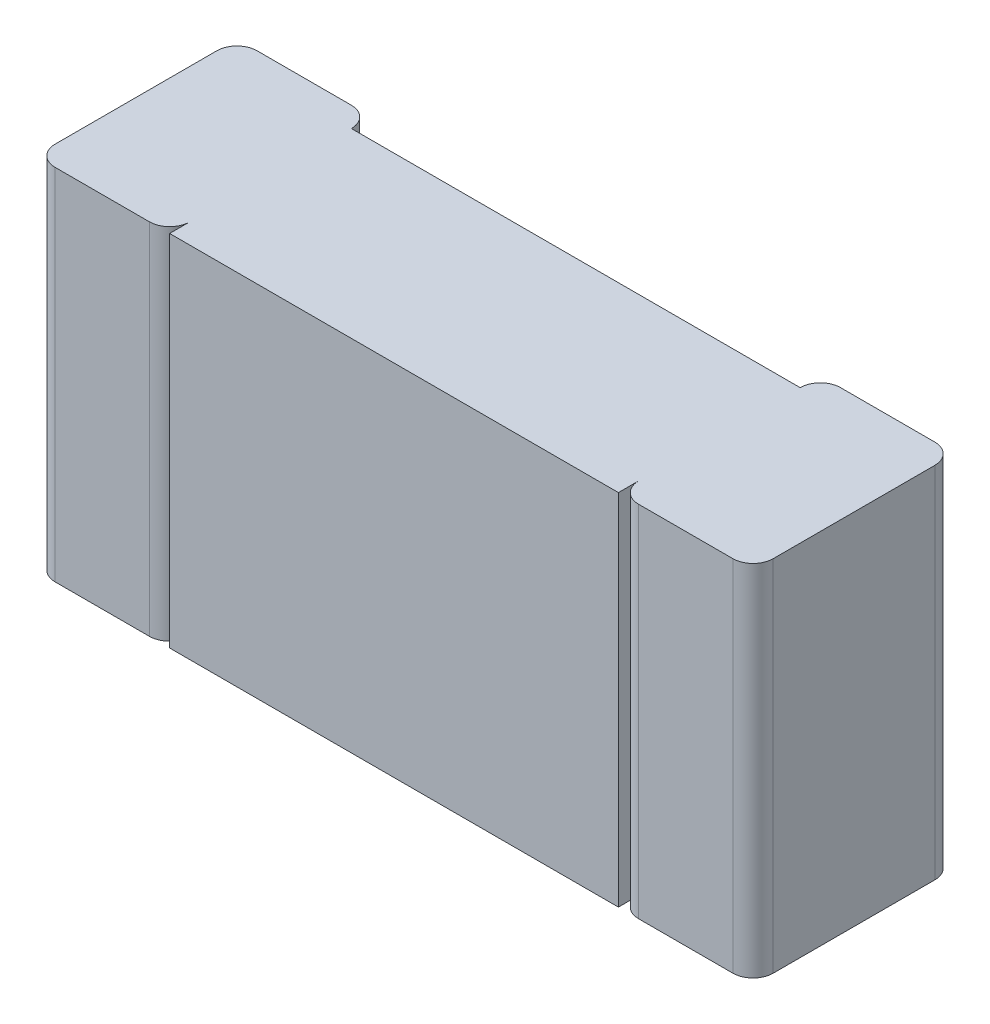
ISO-10303-21;
HEADER;
FILE_DESCRIPTION(('STEP AP214'),'2;1');
FILE_NAME('part.step','',(''),(''),'','','');
FILE_SCHEMA(('AUTOMOTIVE_DESIGN { 1 0 10303 214 1 1 1 1 }'));
ENDSEC;
DATA;
#1=APPLICATION_CONTEXT('core data for automotive mechanical design processes');
#2=APPLICATION_PROTOCOL_DEFINITION('international standard','automotive_design',2000,#1);
#3=PRODUCT_CONTEXT('',#1,'mechanical');
#4=PRODUCT('Part','Part','',(#3));
#5=PRODUCT_RELATED_PRODUCT_CATEGORY('part','',(#4));
#6=PRODUCT_DEFINITION_FORMATION('','',#4);
#7=PRODUCT_DEFINITION_CONTEXT('part definition',#1,'design');
#8=PRODUCT_DEFINITION('design','',#6,#7);
#9=PRODUCT_DEFINITION_SHAPE('','',#8);
#10=(LENGTH_UNIT() NAMED_UNIT(*) SI_UNIT(.MILLI.,.METRE.));
#11=(NAMED_UNIT(*) PLANE_ANGLE_UNIT() SI_UNIT($,.RADIAN.));
#12=(NAMED_UNIT(*) SI_UNIT($,.STERADIAN.) SOLID_ANGLE_UNIT());
#13=UNCERTAINTY_MEASURE_WITH_UNIT(LENGTH_MEASURE(1.E-05),#10,'distance_accuracy_value','');
#14=(GEOMETRIC_REPRESENTATION_CONTEXT(3) GLOBAL_UNCERTAINTY_ASSIGNED_CONTEXT((#13)) GLOBAL_UNIT_ASSIGNED_CONTEXT((#10,
#11,#12)) REPRESENTATION_CONTEXT('',''));
#15=CARTESIAN_POINT('',(0.,0.,0.));
#16=DIRECTION('',(0.,0.,1.));
#17=DIRECTION('',(1.,0.,0.));
#18=AXIS2_PLACEMENT_3D('',#15,#16,#17);
#19=CARTESIAN_POINT('',(-0.5,-0.4,0.405));
#20=DIRECTION('',(1.,0.,0.));
#21=DIRECTION('',(0.,0.,-1.));
#22=AXIS2_PLACEMENT_3D('',#19,#20,#21);
#23=PLANE('',#22);
#24=DIRECTION('',(0.,0.,-1.));
#25=VECTOR('',#24,1.);
#26=CARTESIAN_POINT('',(-0.5,0.4,0.405));
#27=LINE('',#26,#25);
#28=CARTESIAN_POINT('',(-0.5,0.4,0.405));
#29=VERTEX_POINT('',#28);
#30=CARTESIAN_POINT('',(-0.5,0.4,0.45));
#31=VERTEX_POINT('',#30);
#32=EDGE_CURVE('E197',#29,#31,#27,.F.);
#33=ORIENTED_EDGE('',*,*,#32,.F.);
#34=DIRECTION('',(0.,1.,0.));
#35=VECTOR('',#34,1.);
#36=CARTESIAN_POINT('',(-0.5,-0.4,0.405));
#37=LINE('',#36,#35);
#38=CARTESIAN_POINT('',(-0.5,-0.4,0.405));
#39=VERTEX_POINT('',#38);
#40=EDGE_CURVE('E182',#39,#29,#37,.T.);
#41=ORIENTED_EDGE('',*,*,#40,.F.);
#42=DIRECTION('',(0.,0.,-1.));
#43=VECTOR('',#42,1.);
#44=CARTESIAN_POINT('',(-0.5,-0.4,0.405));
#45=LINE('',#44,#43);
#46=CARTESIAN_POINT('',(-0.5,-0.4,0.45));
#47=VERTEX_POINT('',#46);
#48=EDGE_CURVE('E200',#47,#39,#45,.T.);
#49=ORIENTED_EDGE('',*,*,#48,.F.);
#50=DIRECTION('',(0.,1.,0.));
#51=VECTOR('',#50,1.);
#52=CARTESIAN_POINT('',(-0.5,-0.4,0.45));
#53=LINE('',#52,#51);
#54=EDGE_CURVE('E188',#31,#47,#53,.F.);
#55=ORIENTED_EDGE('',*,*,#54,.F.);
#56=EDGE_LOOP('',(#33,#41,#49,#55));
#57=FACE_BOUND('',#56,.T.);
#58=ADVANCED_FACE('F17',(#57),#23,.F.);
#59=CARTESIAN_POINT('',(0.5,-0.4,0.405));
#60=DIRECTION('',(1.,0.,0.));
#61=DIRECTION('',(0.,0.,-1.));
#62=AXIS2_PLACEMENT_3D('',#59,#60,#61);
#63=PLANE('',#62);
#64=DIRECTION('',(0.,0.,-1.));
#65=VECTOR('',#64,1.);
#66=CARTESIAN_POINT('',(0.5,0.4,0.405));
#67=LINE('',#66,#65);
#68=CARTESIAN_POINT('',(0.5,0.4,0.405));
#69=VERTEX_POINT('',#68);
#70=CARTESIAN_POINT('',(0.5,0.4,0.45));
#71=VERTEX_POINT('',#70);
#72=EDGE_CURVE('E143',#69,#71,#67,.F.);
#73=ORIENTED_EDGE('',*,*,#72,.T.);
#74=DIRECTION('',(0.,1.,0.));
#75=VECTOR('',#74,1.);
#76=CARTESIAN_POINT('',(0.5,-0.4,0.45));
#77=LINE('',#76,#75);
#78=CARTESIAN_POINT('',(0.5,-0.4,0.45));
#79=VERTEX_POINT('',#78);
#80=EDGE_CURVE('E177',#79,#71,#77,.T.);
#81=ORIENTED_EDGE('',*,*,#80,.F.);
#82=DIRECTION('',(0.,0.,-1.));
#83=VECTOR('',#82,1.);
#84=CARTESIAN_POINT('',(0.5,-0.4,0.405));
#85=LINE('',#84,#83);
#86=CARTESIAN_POINT('',(0.5,-0.4,0.405));
#87=VERTEX_POINT('',#86);
#88=EDGE_CURVE('E193',#79,#87,#85,.T.);
#89=ORIENTED_EDGE('',*,*,#88,.T.);
#90=DIRECTION('',(0.,1.,0.));
#91=VECTOR('',#90,1.);
#92=CARTESIAN_POINT('',(0.5,-0.4,0.405));
#93=LINE('',#92,#91);
#94=EDGE_CURVE('E174',#69,#87,#93,.F.);
#95=ORIENTED_EDGE('',*,*,#94,.F.);
#96=EDGE_LOOP('',(#73,#81,#89,#95));
#97=FACE_BOUND('',#96,.T.);
#98=ADVANCED_FACE('F419',(#97),#63,.T.);
#99=CARTESIAN_POINT('',(-0.755,-0.4,0.045));
#100=DIRECTION('',(0.,1.,0.));
#101=DIRECTION('',(0.,0.,1.));
#102=AXIS2_PLACEMENT_3D('',#99,#100,#101);
#103=CYLINDRICAL_SURFACE('',#102,0.045);
#104=DIRECTION('',(0.,1.,0.));
#105=VECTOR('',#104,1.);
#106=CARTESIAN_POINT('',(-0.755,-0.4,0.));
#107=LINE('',#106,#105);
#108=CARTESIAN_POINT('',(-0.755,0.4,0.));
#109=VERTEX_POINT('',#108);
#110=CARTESIAN_POINT('',(-0.755,-0.4,0.));
#111=VERTEX_POINT('',#110);
#112=EDGE_CURVE('E129',#109,#111,#107,.F.);
#113=ORIENTED_EDGE('',*,*,#112,.T.);
#114=CARTESIAN_POINT('',(-0.755,-0.4,0.045));
#115=DIRECTION('',(0.,1.,0.));
#116=DIRECTION('',(0.,0.,1.));
#117=AXIS2_PLACEMENT_3D('',#114,#115,#116);
#118=CIRCLE('',#117,0.045);
#119=CARTESIAN_POINT('',(-0.8,-0.4,0.045));
#120=VERTEX_POINT('',#119);
#121=EDGE_CURVE('E20',#111,#120,#118,.T.);
#122=ORIENTED_EDGE('',*,*,#121,.T.);
#123=DIRECTION('',(0.,1.,0.));
#124=VECTOR('',#123,1.);
#125=CARTESIAN_POINT('',(-0.8,-0.4,0.045));
#126=LINE('',#125,#124);
#127=CARTESIAN_POINT('',(-0.8,0.4,0.045));
#128=VERTEX_POINT('',#127);
#129=EDGE_CURVE('E136',#120,#128,#126,.T.);
#130=ORIENTED_EDGE('',*,*,#129,.T.);
#131=CARTESIAN_POINT('',(-0.755,0.4,0.045));
#132=DIRECTION('',(0.,1.,0.));
#133=DIRECTION('',(0.,0.,1.));
#134=AXIS2_PLACEMENT_3D('',#131,#132,#133);
#135=CIRCLE('',#134,0.045);
#136=EDGE_CURVE('E250',#109,#128,#135,.T.);
#137=ORIENTED_EDGE('',*,*,#136,.F.);
#138=EDGE_LOOP('',(#113,#122,#130,#137));
#139=FACE_BOUND('',#138,.T.);
#140=ADVANCED_FACE('F154',(#139),#103,.T.);
#141=CARTESIAN_POINT('',(-0.8,-0.4,0.));
#142=DIRECTION('',(1.,0.,0.));
#143=DIRECTION('',(0.,0.,-1.));
#144=AXIS2_PLACEMENT_3D('',#141,#142,#143);
#145=PLANE('',#144);
#146=DIRECTION('',(0.,0.,1.));
#147=VECTOR('',#146,1.);
#148=CARTESIAN_POINT('',(-0.8,0.4,0.));
#149=LINE('',#148,#147);
#150=CARTESIAN_POINT('',(-0.8,0.4,0.405));
#151=VERTEX_POINT('',#150);
#152=EDGE_CURVE('E141',#128,#151,#149,.T.);
#153=ORIENTED_EDGE('',*,*,#152,.F.);
#154=ORIENTED_EDGE('',*,*,#129,.F.);
#155=DIRECTION('',(0.,0.,1.));
#156=VECTOR('',#155,1.);
#157=CARTESIAN_POINT('',(-0.8,-0.4,0.));
#158=LINE('',#157,#156);
#159=CARTESIAN_POINT('',(-0.8,-0.4,0.405));
#160=VERTEX_POINT('',#159);
#161=EDGE_CURVE('E140',#120,#160,#158,.T.);
#162=ORIENTED_EDGE('',*,*,#161,.T.);
#163=DIRECTION('',(0.,1.,0.));
#164=VECTOR('',#163,1.);
#165=CARTESIAN_POINT('',(-0.8,-0.4,0.405));
#166=LINE('',#165,#164);
#167=EDGE_CURVE('E142',#151,#160,#166,.F.);
#168=ORIENTED_EDGE('',*,*,#167,.F.);
#169=EDGE_LOOP('',(#153,#154,#162,#168));
#170=FACE_BOUND('',#169,.T.);
#171=ADVANCED_FACE('F138',(#170),#145,.F.);
#172=CARTESIAN_POINT('',(-0.755,-0.4,0.405));
#173=DIRECTION('',(0.,1.,0.));
#174=DIRECTION('',(0.,0.,1.));
#175=AXIS2_PLACEMENT_3D('',#172,#173,#174);
#176=CYLINDRICAL_SURFACE('',#175,0.045);
#177=CARTESIAN_POINT('',(-0.755,0.4,0.405));
#178=DIRECTION('',(0.,1.,0.));
#179=DIRECTION('',(0.,0.,1.));
#180=AXIS2_PLACEMENT_3D('',#177,#178,#179);
#181=CIRCLE('',#180,0.045);
#182=CARTESIAN_POINT('',(-0.755,0.4,0.45));
#183=VERTEX_POINT('',#182);
#184=EDGE_CURVE('E248',#151,#183,#181,.T.);
#185=ORIENTED_EDGE('',*,*,#184,.F.);
#186=ORIENTED_EDGE('',*,*,#167,.T.);
#187=CARTESIAN_POINT('',(-0.755,-0.4,0.405));
#188=DIRECTION('',(0.,1.,0.));
#189=DIRECTION('',(0.,0.,1.));
#190=AXIS2_PLACEMENT_3D('',#187,#188,#189);
#191=CIRCLE('',#190,0.045);
#192=CARTESIAN_POINT('',(-0.755,-0.4,0.45));
#193=VERTEX_POINT('',#192);
#194=EDGE_CURVE('E152',#160,#193,#191,.T.);
#195=ORIENTED_EDGE('',*,*,#194,.T.);
#196=DIRECTION('',(0.,1.,0.));
#197=VECTOR('',#196,1.);
#198=CARTESIAN_POINT('',(-0.755,-0.4,0.45));
#199=LINE('',#198,#197);
#200=EDGE_CURVE('E186',#183,#193,#199,.F.);
#201=ORIENTED_EDGE('',*,*,#200,.F.);
#202=EDGE_LOOP('',(#185,#186,#195,#201));
#203=FACE_BOUND('',#202,.T.);
#204=ADVANCED_FACE('F449',(#203),#176,.T.);
#205=CARTESIAN_POINT('',(-0.8,-0.4,0.45));
#206=DIRECTION('',(0.,0.,1.));
#207=DIRECTION('',(1.,0.,0.));
#208=AXIS2_PLACEMENT_3D('',#205,#206,#207);
#209=PLANE('',#208);
#210=DIRECTION('',(1.,0.,0.));
#211=VECTOR('',#210,1.);
#212=CARTESIAN_POINT('',(-0.8,-0.4,0.45));
#213=LINE('',#212,#211);
#214=CARTESIAN_POINT('',(-0.545,-0.4,0.45));
#215=VERTEX_POINT('',#214);
#216=EDGE_CURVE('E265',#193,#215,#213,.T.);
#217=ORIENTED_EDGE('',*,*,#216,.T.);
#218=DIRECTION('',(0.,1.,0.));
#219=VECTOR('',#218,1.);
#220=CARTESIAN_POINT('',(-0.545,-0.4,0.45));
#221=LINE('',#220,#219);
#222=CARTESIAN_POINT('',(-0.545,0.4,0.45));
#223=VERTEX_POINT('',#222);
#224=EDGE_CURVE('E185',#223,#215,#221,.F.);
#225=ORIENTED_EDGE('',*,*,#224,.F.);
#226=DIRECTION('',(1.,0.,0.));
#227=VECTOR('',#226,1.);
#228=CARTESIAN_POINT('',(-0.8,0.4,0.45));
#229=LINE('',#228,#227);
#230=EDGE_CURVE('E247',#183,#223,#229,.T.);
#231=ORIENTED_EDGE('',*,*,#230,.F.);
#232=ORIENTED_EDGE('',*,*,#200,.T.);
#233=EDGE_LOOP('',(#217,#225,#231,#232));
#234=FACE_BOUND('',#233,.T.);
#235=ADVANCED_FACE('F456',(#234),#209,.T.);
#236=CARTESIAN_POINT('',(-0.545,-0.4,0.405));
#237=DIRECTION('',(0.,1.,0.));
#238=DIRECTION('',(0.,0.,1.));
#239=AXIS2_PLACEMENT_3D('',#236,#237,#238);
#240=CYLINDRICAL_SURFACE('',#239,0.045);
#241=ORIENTED_EDGE('',*,*,#224,.T.);
#242=CARTESIAN_POINT('',(-0.545,-0.4,0.405));
#243=DIRECTION('',(0.,1.,0.));
#244=DIRECTION('',(0.,0.,1.));
#245=AXIS2_PLACEMENT_3D('',#242,#243,#244);
#246=CIRCLE('',#245,0.045);
#247=EDGE_CURVE('E221',#215,#39,#246,.T.);
#248=ORIENTED_EDGE('',*,*,#247,.T.);
#249=ORIENTED_EDGE('',*,*,#40,.T.);
#250=CARTESIAN_POINT('',(-0.545,0.4,0.405));
#251=DIRECTION('',(0.,1.,0.));
#252=DIRECTION('',(0.,0.,1.));
#253=AXIS2_PLACEMENT_3D('',#250,#251,#252);
#254=CIRCLE('',#253,0.045);
#255=EDGE_CURVE('E216',#223,#29,#254,.T.);
#256=ORIENTED_EDGE('',*,*,#255,.F.);
#257=EDGE_LOOP('',(#241,#248,#249,#256));
#258=FACE_BOUND('',#257,.T.);
#259=ADVANCED_FACE('F409',(#258),#240,.T.);
#260=CARTESIAN_POINT('',(-0.5,-0.4,0.45));
#261=DIRECTION('',(0.,0.,1.));
#262=DIRECTION('',(1.,0.,0.));
#263=AXIS2_PLACEMENT_3D('',#260,#261,#262);
#264=PLANE('',#263);
#265=ORIENTED_EDGE('',*,*,#80,.T.);
#266=DIRECTION('',(1.,0.,0.));
#267=VECTOR('',#266,1.);
#268=CARTESIAN_POINT('',(-0.5,0.4,0.45));
#269=LINE('',#268,#267);
#270=EDGE_CURVE('E212',#31,#71,#269,.T.);
#271=ORIENTED_EDGE('',*,*,#270,.F.);
#272=ORIENTED_EDGE('',*,*,#54,.T.);
#273=DIRECTION('',(1.,0.,0.));
#274=VECTOR('',#273,1.);
#275=CARTESIAN_POINT('',(-0.5,-0.4,0.45));
#276=LINE('',#275,#274);
#277=EDGE_CURVE('E181',#47,#79,#276,.T.);
#278=ORIENTED_EDGE('',*,*,#277,.T.);
#279=EDGE_LOOP('',(#265,#271,#272,#278));
#280=FACE_BOUND('',#279,.T.);
#281=ADVANCED_FACE('F377',(#280),#264,.T.);
#282=CARTESIAN_POINT('',(0.545,-0.4,0.405));
#283=DIRECTION('',(0.,1.,0.));
#284=DIRECTION('',(0.,0.,1.));
#285=AXIS2_PLACEMENT_3D('',#282,#283,#284);
#286=CYLINDRICAL_SURFACE('',#285,0.045);
#287=CARTESIAN_POINT('',(0.545,0.4,0.405));
#288=DIRECTION('',(0.,1.,0.));
#289=DIRECTION('',(0.,0.,1.));
#290=AXIS2_PLACEMENT_3D('',#287,#288,#289);
#291=CIRCLE('',#290,0.045);
#292=CARTESIAN_POINT('',(0.545,0.4,0.45));
#293=VERTEX_POINT('',#292);
#294=EDGE_CURVE('E243',#69,#293,#291,.T.);
#295=ORIENTED_EDGE('',*,*,#294,.F.);
#296=ORIENTED_EDGE('',*,*,#94,.T.);
#297=CARTESIAN_POINT('',(0.545,-0.4,0.405));
#298=DIRECTION('',(0.,1.,0.));
#299=DIRECTION('',(0.,0.,1.));
#300=AXIS2_PLACEMENT_3D('',#297,#298,#299);
#301=CIRCLE('',#300,0.045);
#302=CARTESIAN_POINT('',(0.545,-0.4,0.45));
#303=VERTEX_POINT('',#302);
#304=EDGE_CURVE('E261',#87,#303,#301,.T.);
#305=ORIENTED_EDGE('',*,*,#304,.T.);
#306=DIRECTION('',(0.,1.,0.));
#307=VECTOR('',#306,1.);
#308=CARTESIAN_POINT('',(0.545,-0.4,0.45));
#309=LINE('',#308,#307);
#310=EDGE_CURVE('E172',#293,#303,#309,.F.);
#311=ORIENTED_EDGE('',*,*,#310,.F.);
#312=EDGE_LOOP('',(#295,#296,#305,#311));
#313=FACE_BOUND('',#312,.T.);
#314=ADVANCED_FACE('F408',(#313),#286,.T.);
#315=CARTESIAN_POINT('',(0.5,-0.4,0.45));
#316=DIRECTION('',(0.,0.,1.));
#317=DIRECTION('',(1.,0.,0.));
#318=AXIS2_PLACEMENT_3D('',#315,#316,#317);
#319=PLANE('',#318);
#320=DIRECTION('',(1.,0.,0.));
#321=VECTOR('',#320,1.);
#322=CARTESIAN_POINT('',(0.5,-0.4,0.45));
#323=LINE('',#322,#321);
#324=CARTESIAN_POINT('',(0.755,-0.4,0.45));
#325=VERTEX_POINT('',#324);
#326=EDGE_CURVE('E260',#303,#325,#323,.T.);
#327=ORIENTED_EDGE('',*,*,#326,.T.);
#328=DIRECTION('',(0.,1.,0.));
#329=VECTOR('',#328,1.);
#330=CARTESIAN_POINT('',(0.755,-0.4,0.45));
#331=LINE('',#330,#329);
#332=CARTESIAN_POINT('',(0.755,0.4,0.45));
#333=VERTEX_POINT('',#332);
#334=EDGE_CURVE('E170',#333,#325,#331,.F.);
#335=ORIENTED_EDGE('',*,*,#334,.F.);
#336=DIRECTION('',(1.,0.,0.));
#337=VECTOR('',#336,1.);
#338=CARTESIAN_POINT('',(0.5,0.4,0.45));
#339=LINE('',#338,#337);
#340=EDGE_CURVE('E242',#293,#333,#339,.T.);
#341=ORIENTED_EDGE('',*,*,#340,.F.);
#342=ORIENTED_EDGE('',*,*,#310,.T.);
#343=EDGE_LOOP('',(#327,#335,#341,#342));
#344=FACE_BOUND('',#343,.T.);
#345=ADVANCED_FACE('F474',(#344),#319,.T.);
#346=CARTESIAN_POINT('',(0.755,-0.4,0.405));
#347=DIRECTION('',(0.,1.,0.));
#348=DIRECTION('',(0.,0.,1.));
#349=AXIS2_PLACEMENT_3D('',#346,#347,#348);
#350=CYLINDRICAL_SURFACE('',#349,0.045);
#351=ORIENTED_EDGE('',*,*,#334,.T.);
#352=CARTESIAN_POINT('',(0.755,-0.4,0.405));
#353=DIRECTION('',(0.,1.,0.));
#354=DIRECTION('',(0.,0.,1.));
#355=AXIS2_PLACEMENT_3D('',#352,#353,#354);
#356=CIRCLE('',#355,0.045);
#357=CARTESIAN_POINT('',(0.8,-0.4,0.405));
#358=VERTEX_POINT('',#357);
#359=EDGE_CURVE('E257',#325,#358,#356,.T.);
#360=ORIENTED_EDGE('',*,*,#359,.T.);
#361=DIRECTION('',(0.,1.,0.));
#362=VECTOR('',#361,1.);
#363=CARTESIAN_POINT('',(0.8,-0.4,0.405));
#364=LINE('',#363,#362);
#365=CARTESIAN_POINT('',(0.8,0.4,0.405));
#366=VERTEX_POINT('',#365);
#367=EDGE_CURVE('E168',#366,#358,#364,.F.);
#368=ORIENTED_EDGE('',*,*,#367,.F.);
#369=CARTESIAN_POINT('',(0.755,0.4,0.405));
#370=DIRECTION('',(0.,1.,0.));
#371=DIRECTION('',(0.,0.,1.));
#372=AXIS2_PLACEMENT_3D('',#369,#370,#371);
#373=CIRCLE('',#372,0.045);
#374=EDGE_CURVE('E240',#333,#366,#373,.T.);
#375=ORIENTED_EDGE('',*,*,#374,.F.);
#376=EDGE_LOOP('',(#351,#360,#368,#375));
#377=FACE_BOUND('',#376,.T.);
#378=ADVANCED_FACE('F481',(#377),#350,.T.);
#379=CARTESIAN_POINT('',(0.8,-0.4,0.));
#380=DIRECTION('',(1.,0.,0.));
#381=DIRECTION('',(0.,0.,-1.));
#382=AXIS2_PLACEMENT_3D('',#379,#380,#381);
#383=PLANE('',#382);
#384=DIRECTION('',(0.,0.,1.));
#385=VECTOR('',#384,1.);
#386=CARTESIAN_POINT('',(0.8,0.4,0.));
#387=LINE('',#386,#385);
#388=CARTESIAN_POINT('',(0.8,0.4,0.045));
#389=VERTEX_POINT('',#388);
#390=EDGE_CURVE('E239',#366,#389,#387,.F.);
#391=ORIENTED_EDGE('',*,*,#390,.F.);
#392=ORIENTED_EDGE('',*,*,#367,.T.);
#393=DIRECTION('',(0.,0.,1.));
#394=VECTOR('',#393,1.);
#395=CARTESIAN_POINT('',(0.8,-0.4,0.));
#396=LINE('',#395,#394);
#397=CARTESIAN_POINT('',(0.8,-0.4,0.045));
#398=VERTEX_POINT('',#397);
#399=EDGE_CURVE('E256',#358,#398,#396,.F.);
#400=ORIENTED_EDGE('',*,*,#399,.T.);
#401=DIRECTION('',(0.,1.,0.));
#402=VECTOR('',#401,1.);
#403=CARTESIAN_POINT('',(0.8,-0.4,0.045));
#404=LINE('',#403,#402);
#405=EDGE_CURVE('E159',#389,#398,#404,.F.);
#406=ORIENTED_EDGE('',*,*,#405,.F.);
#407=EDGE_LOOP('',(#391,#392,#400,#406));
#408=FACE_BOUND('',#407,.T.);
#409=ADVANCED_FACE('F300',(#408),#383,.T.);
#410=CARTESIAN_POINT('',(0.755,-0.4,0.045));
#411=DIRECTION('',(0.,1.,0.));
#412=DIRECTION('',(0.,0.,1.));
#413=AXIS2_PLACEMENT_3D('',#410,#411,#412);
#414=CYLINDRICAL_SURFACE('',#413,0.045);
#415=CARTESIAN_POINT('',(0.755,0.4,0.045));
#416=DIRECTION('',(0.,1.,0.));
#417=DIRECTION('',(0.,0.,1.));
#418=AXIS2_PLACEMENT_3D('',#415,#416,#417);
#419=CIRCLE('',#418,0.045);
#420=CARTESIAN_POINT('',(0.755,0.4,0.));
#421=VERTEX_POINT('',#420);
#422=EDGE_CURVE('E236',#389,#421,#419,.T.);
#423=ORIENTED_EDGE('',*,*,#422,.F.);
#424=ORIENTED_EDGE('',*,*,#405,.T.);
#425=CARTESIAN_POINT('',(0.755,-0.4,0.045));
#426=DIRECTION('',(0.,1.,0.));
#427=DIRECTION('',(0.,0.,1.));
#428=AXIS2_PLACEMENT_3D('',#425,#426,#427);
#429=CIRCLE('',#428,0.045);
#430=CARTESIAN_POINT('',(0.755,-0.4,0.));
#431=VERTEX_POINT('',#430);
#432=EDGE_CURVE('E253',#398,#431,#429,.T.);
#433=ORIENTED_EDGE('',*,*,#432,.T.);
#434=DIRECTION('',(0.,1.,0.));
#435=VECTOR('',#434,1.);
#436=CARTESIAN_POINT('',(0.755,-0.4,0.));
#437=LINE('',#436,#435);
#438=EDGE_CURVE('E178',#431,#421,#437,.T.);
#439=ORIENTED_EDGE('',*,*,#438,.T.);
#440=EDGE_LOOP('',(#423,#424,#433,#439));
#441=FACE_BOUND('',#440,.T.);
#442=ADVANCED_FACE('F304',(#441),#414,.T.);
#443=CARTESIAN_POINT('',(-0.8,-0.4,0.));
#444=DIRECTION('',(0.,0.,1.));
#445=DIRECTION('',(1.,0.,0.));
#446=AXIS2_PLACEMENT_3D('',#443,#444,#445);
#447=PLANE('',#446);
#448=DIRECTION('',(1.,0.,0.));
#449=VECTOR('',#448,1.);
#450=CARTESIAN_POINT('',(-0.8,-0.4,0.));
#451=LINE('',#450,#449);
#452=CARTESIAN_POINT('',(-0.545,-0.4,0.));
#453=VERTEX_POINT('',#452);
#454=EDGE_CURVE('E155',#453,#111,#451,.F.);
#455=ORIENTED_EDGE('',*,*,#454,.T.);
#456=ORIENTED_EDGE('',*,*,#112,.F.);
#457=DIRECTION('',(1.,0.,0.));
#458=VECTOR('',#457,1.);
#459=CARTESIAN_POINT('',(-0.8,0.4,0.));
#460=LINE('',#459,#458);
#461=CARTESIAN_POINT('',(-0.545,0.4,0.));
#462=VERTEX_POINT('',#461);
#463=EDGE_CURVE('E252',#462,#109,#460,.F.);
#464=ORIENTED_EDGE('',*,*,#463,.F.);
#465=DIRECTION('',(0.,1.,0.));
#466=VECTOR('',#465,1.);
#467=CARTESIAN_POINT('',(-0.545,-0.4,0.));
#468=LINE('',#467,#466);
#469=EDGE_CURVE('E163',#453,#462,#468,.T.);
#470=ORIENTED_EDGE('',*,*,#469,.F.);
#471=EDGE_LOOP('',(#455,#456,#464,#470));
#472=FACE_BOUND('',#471,.T.);
#473=ADVANCED_FACE('F321',(#472),#447,.F.);
#474=CARTESIAN_POINT('',(0.5,-0.4,0.));
#475=DIRECTION('',(0.,0.,1.));
#476=DIRECTION('',(1.,0.,0.));
#477=AXIS2_PLACEMENT_3D('',#474,#475,#476);
#478=PLANE('',#477);
#479=DIRECTION('',(1.,0.,0.));
#480=VECTOR('',#479,1.);
#481=CARTESIAN_POINT('',(0.5,-0.4,0.));
#482=LINE('',#481,#480);
#483=CARTESIAN_POINT('',(0.545,-0.4,0.));
#484=VERTEX_POINT('',#483);
#485=EDGE_CURVE('E180',#431,#484,#482,.F.);
#486=ORIENTED_EDGE('',*,*,#485,.T.);
#487=DIRECTION('',(0.,1.,0.));
#488=VECTOR('',#487,1.);
#489=CARTESIAN_POINT('',(0.545,-0.4,0.));
#490=LINE('',#489,#488);
#491=CARTESIAN_POINT('',(0.545,0.4,0.));
#492=VERTEX_POINT('',#491);
#493=EDGE_CURVE('E231',#492,#484,#490,.F.);
#494=ORIENTED_EDGE('',*,*,#493,.F.);
#495=DIRECTION('',(1.,0.,0.));
#496=VECTOR('',#495,1.);
#497=CARTESIAN_POINT('',(0.5,0.4,0.));
#498=LINE('',#497,#496);
#499=EDGE_CURVE('E215',#421,#492,#498,.F.);
#500=ORIENTED_EDGE('',*,*,#499,.F.);
#501=ORIENTED_EDGE('',*,*,#438,.F.);
#502=EDGE_LOOP('',(#486,#494,#500,#501));
#503=FACE_BOUND('',#502,.T.);
#504=ADVANCED_FACE('F307',(#503),#478,.F.);
#505=CARTESIAN_POINT('',(-0.545,-0.4,0.045));
#506=DIRECTION('',(0.,1.,0.));
#507=DIRECTION('',(0.,0.,1.));
#508=AXIS2_PLACEMENT_3D('',#505,#506,#507);
#509=CYLINDRICAL_SURFACE('',#508,0.045);
#510=CARTESIAN_POINT('',(-0.545,0.4,0.045));
#511=DIRECTION('',(0.,1.,0.));
#512=DIRECTION('',(0.,0.,1.));
#513=AXIS2_PLACEMENT_3D('',#510,#511,#512);
#514=CIRCLE('',#513,0.045);
#515=CARTESIAN_POINT('',(-0.5,0.4,0.045));
#516=VERTEX_POINT('',#515);
#517=EDGE_CURVE('E165',#462,#516,#514,.F.);
#518=ORIENTED_EDGE('',*,*,#517,.T.);
#519=DIRECTION('',(0.,1.,0.));
#520=VECTOR('',#519,1.);
#521=CARTESIAN_POINT('',(-0.5,-0.4,0.045));
#522=LINE('',#521,#520);
#523=CARTESIAN_POINT('',(-0.5,-0.4,0.045));
#524=VERTEX_POINT('',#523);
#525=EDGE_CURVE('E230',#516,#524,#522,.F.);
#526=ORIENTED_EDGE('',*,*,#525,.T.);
#527=CARTESIAN_POINT('',(-0.545,-0.4,0.045));
#528=DIRECTION('',(0.,1.,0.));
#529=DIRECTION('',(0.,0.,1.));
#530=AXIS2_PLACEMENT_3D('',#527,#528,#529);
#531=CIRCLE('',#530,0.045);
#532=EDGE_CURVE('E166',#524,#453,#531,.T.);
#533=ORIENTED_EDGE('',*,*,#532,.T.);
#534=ORIENTED_EDGE('',*,*,#469,.T.);
#535=EDGE_LOOP('',(#518,#526,#533,#534));
#536=FACE_BOUND('',#535,.T.);
#537=ADVANCED_FACE('F320',(#536),#509,.T.);
#538=CARTESIAN_POINT('',(-0.755,-0.4,0.045));
#539=DIRECTION('',(0.,1.,0.));
#540=DIRECTION('',(0.,0.,1.));
#541=AXIS2_PLACEMENT_3D('',#538,#539,#540);
#542=PLANE('',#541);
#543=DIRECTION('',(1.,0.,0.));
#544=VECTOR('',#543,1.);
#545=CARTESIAN_POINT('',(-0.755,-0.4,0.045));
#546=LINE('',#545,#544);
#547=CARTESIAN_POINT('',(0.5,-0.4,0.045));
#548=VERTEX_POINT('',#547);
#549=EDGE_CURVE('E272',#524,#548,#546,.T.);
#550=ORIENTED_EDGE('',*,*,#549,.T.);
#551=CARTESIAN_POINT('',(0.545,-0.4,0.045));
#552=DIRECTION('',(0.,1.,0.));
#553=DIRECTION('',(0.,0.,1.));
#554=AXIS2_PLACEMENT_3D('',#551,#552,#553);
#555=CIRCLE('',#554,0.045);
#556=EDGE_CURVE('E228',#484,#548,#555,.T.);
#557=ORIENTED_EDGE('',*,*,#556,.F.);
#558=ORIENTED_EDGE('',*,*,#485,.F.);
#559=ORIENTED_EDGE('',*,*,#432,.F.);
#560=ORIENTED_EDGE('',*,*,#399,.F.);
#561=ORIENTED_EDGE('',*,*,#359,.F.);
#562=ORIENTED_EDGE('',*,*,#326,.F.);
#563=ORIENTED_EDGE('',*,*,#304,.F.);
#564=ORIENTED_EDGE('',*,*,#88,.F.);
#565=ORIENTED_EDGE('',*,*,#277,.F.);
#566=ORIENTED_EDGE('',*,*,#48,.T.);
#567=ORIENTED_EDGE('',*,*,#247,.F.);
#568=ORIENTED_EDGE('',*,*,#216,.F.);
#569=ORIENTED_EDGE('',*,*,#194,.F.);
#570=ORIENTED_EDGE('',*,*,#161,.F.);
#571=ORIENTED_EDGE('',*,*,#121,.F.);
#572=ORIENTED_EDGE('',*,*,#454,.F.);
#573=ORIENTED_EDGE('',*,*,#532,.F.);
#574=EDGE_LOOP('',(#550,#557,#558,#559,#560,#561,#562,#563,#564,#565,#566,#567,#568,#569,#570,
#571,#572,#573));
#575=FACE_BOUND('',#574,.T.);
#576=ADVANCED_FACE('F148',(#575),#542,.F.);
#577=CARTESIAN_POINT('',(0.545,-0.4,0.045));
#578=DIRECTION('',(0.,1.,0.));
#579=DIRECTION('',(0.,0.,1.));
#580=AXIS2_PLACEMENT_3D('',#577,#578,#579);
#581=CYLINDRICAL_SURFACE('',#580,0.045);
#582=ORIENTED_EDGE('',*,*,#493,.T.);
#583=ORIENTED_EDGE('',*,*,#556,.T.);
#584=DIRECTION('',(0.,1.,0.));
#585=VECTOR('',#584,1.);
#586=CARTESIAN_POINT('',(0.5,-0.4,0.045));
#587=LINE('',#586,#585);
#588=CARTESIAN_POINT('',(0.5,0.4,0.045));
#589=VERTEX_POINT('',#588);
#590=EDGE_CURVE('E26',#548,#589,#587,.T.);
#591=ORIENTED_EDGE('',*,*,#590,.T.);
#592=CARTESIAN_POINT('',(0.545,0.4,0.045));
#593=DIRECTION('',(0.,1.,0.));
#594=DIRECTION('',(0.,0.,1.));
#595=AXIS2_PLACEMENT_3D('',#592,#593,#594);
#596=CIRCLE('',#595,0.045);
#597=EDGE_CURVE('E34',#589,#492,#596,.F.);
#598=ORIENTED_EDGE('',*,*,#597,.T.);
#599=EDGE_LOOP('',(#582,#583,#591,#598));
#600=FACE_BOUND('',#599,.T.);
#601=ADVANCED_FACE('F313',(#600),#581,.T.);
#602=CARTESIAN_POINT('',(-0.755,0.4,0.045));
#603=DIRECTION('',(0.,1.,0.));
#604=DIRECTION('',(0.,0.,1.));
#605=AXIS2_PLACEMENT_3D('',#602,#603,#604);
#606=PLANE('',#605);
#607=DIRECTION('',(1.,0.,0.));
#608=VECTOR('',#607,1.);
#609=CARTESIAN_POINT('',(-0.755,0.4,0.045));
#610=LINE('',#609,#608);
#611=EDGE_CURVE('E11',#589,#516,#610,.F.);
#612=ORIENTED_EDGE('',*,*,#611,.T.);
#613=ORIENTED_EDGE('',*,*,#517,.F.);
#614=ORIENTED_EDGE('',*,*,#463,.T.);
#615=ORIENTED_EDGE('',*,*,#136,.T.);
#616=ORIENTED_EDGE('',*,*,#152,.T.);
#617=ORIENTED_EDGE('',*,*,#184,.T.);
#618=ORIENTED_EDGE('',*,*,#230,.T.);
#619=ORIENTED_EDGE('',*,*,#255,.T.);
#620=ORIENTED_EDGE('',*,*,#32,.T.);
#621=ORIENTED_EDGE('',*,*,#270,.T.);
#622=ORIENTED_EDGE('',*,*,#72,.F.);
#623=ORIENTED_EDGE('',*,*,#294,.T.);
#624=ORIENTED_EDGE('',*,*,#340,.T.);
#625=ORIENTED_EDGE('',*,*,#374,.T.);
#626=ORIENTED_EDGE('',*,*,#390,.T.);
#627=ORIENTED_EDGE('',*,*,#422,.T.);
#628=ORIENTED_EDGE('',*,*,#499,.T.);
#629=ORIENTED_EDGE('',*,*,#597,.F.);
#630=EDGE_LOOP('',(#612,#613,#614,#615,#616,#617,#618,#619,#620,#621,#622,#623,#624,#625,#626,
#627,#628,#629));
#631=FACE_BOUND('',#630,.T.);
#632=ADVANCED_FACE('F294',(#631),#606,.T.);
#633=CARTESIAN_POINT('',(-0.755,-0.4,0.045));
#634=DIRECTION('',(0.,0.,1.));
#635=DIRECTION('',(1.,0.,0.));
#636=AXIS2_PLACEMENT_3D('',#633,#634,#635);
#637=PLANE('',#636);
#638=ORIENTED_EDGE('',*,*,#590,.F.);
#639=ORIENTED_EDGE('',*,*,#549,.F.);
#640=ORIENTED_EDGE('',*,*,#525,.F.);
#641=ORIENTED_EDGE('',*,*,#611,.F.);
#642=EDGE_LOOP('',(#638,#639,#640,#641));
#643=FACE_BOUND('',#642,.T.);
#644=ADVANCED_FACE('F315',(#643),#637,.F.);
#645=CLOSED_SHELL('',(#58,#98,#140,#171,#204,#235,#259,#281,#314,#345,#378,#409,#442,#473,#504,
#537,#576,#601,#632,#644));
#646=MANIFOLD_SOLID_BREP('B1',#645);
#647=ADVANCED_BREP_SHAPE_REPRESENTATION('',(#18,#646),#14);
#648=SHAPE_DEFINITION_REPRESENTATION(#9,#647);
ENDSEC;
END-ISO-10303-21;
